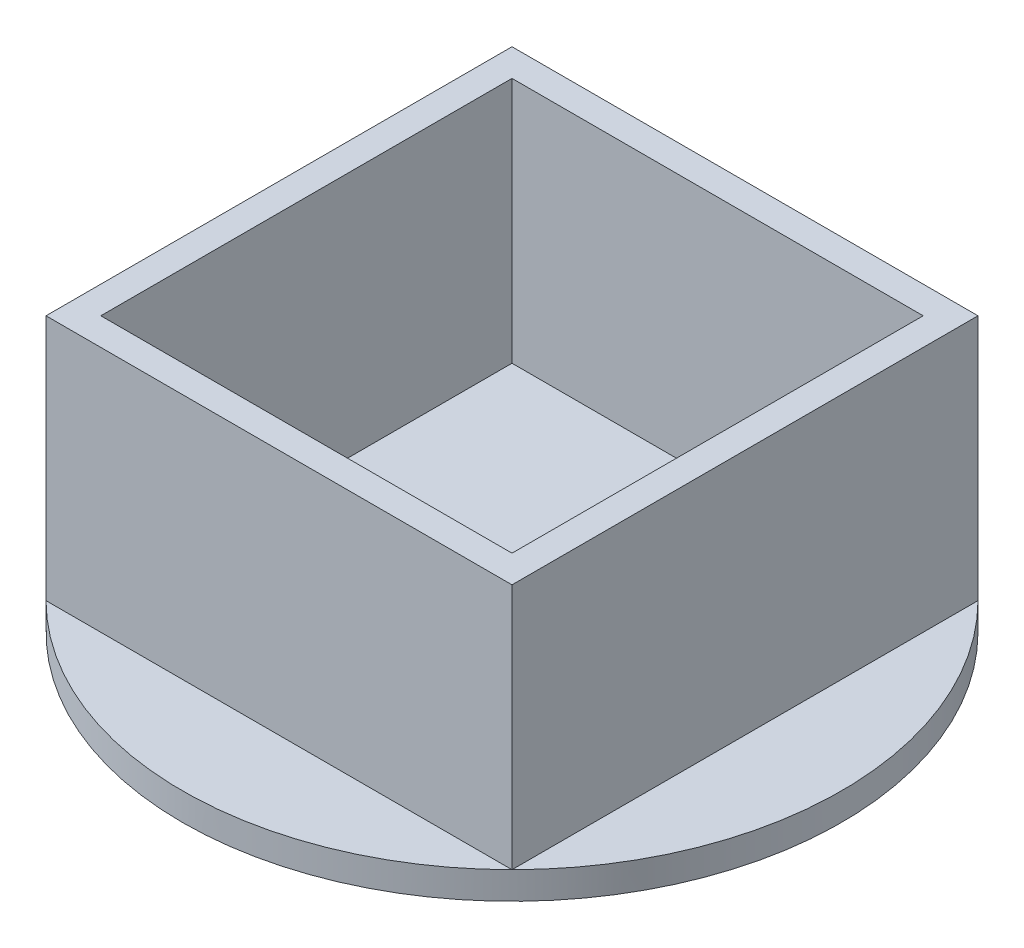
ISO-10303-21;
HEADER;
FILE_DESCRIPTION(('STEP AP214'),'2;1');
FILE_NAME('part.step','',(''),(''),'','','');
FILE_SCHEMA(('AUTOMOTIVE_DESIGN { 1 0 10303 214 1 1 1 1 }'));
ENDSEC;
DATA;
#1=APPLICATION_CONTEXT('core data for automotive mechanical design processes');
#2=APPLICATION_PROTOCOL_DEFINITION('international standard','automotive_design',2000,#1);
#3=PRODUCT_CONTEXT('',#1,'mechanical');
#4=PRODUCT('Part','Part','',(#3));
#5=PRODUCT_RELATED_PRODUCT_CATEGORY('part','',(#4));
#6=PRODUCT_DEFINITION_FORMATION('','',#4);
#7=PRODUCT_DEFINITION_CONTEXT('part definition',#1,'design');
#8=PRODUCT_DEFINITION('design','',#6,#7);
#9=PRODUCT_DEFINITION_SHAPE('','',#8);
#10=(LENGTH_UNIT() NAMED_UNIT(*) SI_UNIT(.MILLI.,.METRE.));
#11=(NAMED_UNIT(*) PLANE_ANGLE_UNIT() SI_UNIT($,.RADIAN.));
#12=(NAMED_UNIT(*) SI_UNIT($,.STERADIAN.) SOLID_ANGLE_UNIT());
#13=UNCERTAINTY_MEASURE_WITH_UNIT(LENGTH_MEASURE(1.E-05),#10,'distance_accuracy_value','');
#14=(GEOMETRIC_REPRESENTATION_CONTEXT(3) GLOBAL_UNCERTAINTY_ASSIGNED_CONTEXT((#13)) GLOBAL_UNIT_ASSIGNED_CONTEXT((#10,
#11,#12)) REPRESENTATION_CONTEXT('',''));
#15=CARTESIAN_POINT('',(0.,0.,0.));
#16=DIRECTION('',(0.,0.,1.));
#17=DIRECTION('',(1.,0.,0.));
#18=AXIS2_PLACEMENT_3D('',#15,#16,#17);
#19=CARTESIAN_POINT('',(0.,10.,0.));
#20=DIRECTION('',(0.,1.,0.));
#21=DIRECTION('',(0.,0.,1.));
#22=AXIS2_PLACEMENT_3D('',#19,#20,#21);
#23=PLANE('',#22);
#24=DIRECTION('',(0.,0.,-1.));
#25=VECTOR('',#24,1.);
#26=CARTESIAN_POINT('',(8.5,10.,-7.5));
#27=LINE('',#26,#25);
#28=CARTESIAN_POINT('',(8.5,10.,8.5));
#29=VERTEX_POINT('',#28);
#30=CARTESIAN_POINT('',(8.5,10.,-8.5));
#31=VERTEX_POINT('',#30);
#32=EDGE_CURVE('E171',#29,#31,#27,.T.);
#33=ORIENTED_EDGE('',*,*,#32,.T.);
#34=DIRECTION('',(-1.,0.,0.));
#35=VECTOR('',#34,1.);
#36=CARTESIAN_POINT('',(-7.5,10.,-8.5));
#37=LINE('',#36,#35);
#38=CARTESIAN_POINT('',(-8.5,10.,-8.5));
#39=VERTEX_POINT('',#38);
#40=EDGE_CURVE('E157',#31,#39,#37,.T.);
#41=ORIENTED_EDGE('',*,*,#40,.T.);
#42=DIRECTION('',(0.,0.,1.));
#43=VECTOR('',#42,1.);
#44=CARTESIAN_POINT('',(-8.5,10.,-7.5));
#45=LINE('',#44,#43);
#46=CARTESIAN_POINT('',(-8.5,10.,8.5));
#47=VERTEX_POINT('',#46);
#48=EDGE_CURVE('E168',#39,#47,#45,.T.);
#49=ORIENTED_EDGE('',*,*,#48,.T.);
#50=DIRECTION('',(1.,0.,0.));
#51=VECTOR('',#50,1.);
#52=CARTESIAN_POINT('',(-7.5,10.,8.5));
#53=LINE('',#52,#51);
#54=EDGE_CURVE('E166',#47,#29,#53,.T.);
#55=ORIENTED_EDGE('',*,*,#54,.T.);
#56=EDGE_LOOP('',(#33,#41,#49,#55));
#57=FACE_BOUND('',#56,.T.);
#58=DIRECTION('',(-1.,0.,0.));
#59=VECTOR('',#58,1.);
#60=CARTESIAN_POINT('',(-7.5,10.,-7.5));
#61=LINE('',#60,#59);
#62=CARTESIAN_POINT('',(7.5,10.,-7.5));
#63=VERTEX_POINT('',#62);
#64=CARTESIAN_POINT('',(-7.5,10.,-7.5));
#65=VERTEX_POINT('',#64);
#66=EDGE_CURVE('E187',#63,#65,#61,.T.);
#67=ORIENTED_EDGE('',*,*,#66,.F.);
#68=DIRECTION('',(0.,0.,-1.));
#69=VECTOR('',#68,1.);
#70=CARTESIAN_POINT('',(7.5,10.,-7.5));
#71=LINE('',#70,#69);
#72=CARTESIAN_POINT('',(7.5,10.,7.5));
#73=VERTEX_POINT('',#72);
#74=EDGE_CURVE('E154',#73,#63,#71,.T.);
#75=ORIENTED_EDGE('',*,*,#74,.F.);
#76=DIRECTION('',(1.,0.,0.));
#77=VECTOR('',#76,1.);
#78=CARTESIAN_POINT('',(-7.5,10.,7.5));
#79=LINE('',#78,#77);
#80=CARTESIAN_POINT('',(-7.5,10.,7.5));
#81=VERTEX_POINT('',#80);
#82=EDGE_CURVE('E182',#81,#73,#79,.T.);
#83=ORIENTED_EDGE('',*,*,#82,.F.);
#84=DIRECTION('',(0.,0.,1.));
#85=VECTOR('',#84,1.);
#86=CARTESIAN_POINT('',(-7.5,10.,-7.5));
#87=LINE('',#86,#85);
#88=EDGE_CURVE('E184',#65,#81,#87,.T.);
#89=ORIENTED_EDGE('',*,*,#88,.F.);
#90=EDGE_LOOP('',(#67,#75,#83,#89));
#91=FACE_BOUND('',#90,.T.);
#92=ADVANCED_FACE('F57',(#57,#91),#23,.T.);
#93=CARTESIAN_POINT('',(8.5,10.,-7.5));
#94=DIRECTION('',(-1.,0.,0.));
#95=DIRECTION('',(0.,0.,1.));
#96=AXIS2_PLACEMENT_3D('',#93,#94,#95);
#97=PLANE('',#96);
#98=DIRECTION('',(0.,-1.,0.));
#99=VECTOR('',#98,1.);
#100=CARTESIAN_POINT('',(8.5,10.,8.5));
#101=LINE('',#100,#99);
#102=CARTESIAN_POINT('',(8.5,0.999999999999999,8.5));
#103=VERTEX_POINT('',#102);
#104=EDGE_CURVE('E153',#29,#103,#101,.T.);
#105=ORIENTED_EDGE('',*,*,#104,.T.);
#106=DIRECTION('',(0.,0.,-1.));
#107=VECTOR('',#106,1.);
#108=CARTESIAN_POINT('',(8.5,0.999999999999999,-7.5));
#109=LINE('',#108,#107);
#110=CARTESIAN_POINT('',(8.5,1.,-8.5));
#111=VERTEX_POINT('',#110);
#112=EDGE_CURVE('E133',#103,#111,#109,.T.);
#113=ORIENTED_EDGE('',*,*,#112,.T.);
#114=DIRECTION('',(0.,-1.,0.));
#115=VECTOR('',#114,1.);
#116=CARTESIAN_POINT('',(8.5,10.,-8.5));
#117=LINE('',#116,#115);
#118=EDGE_CURVE('E65',#31,#111,#117,.T.);
#119=ORIENTED_EDGE('',*,*,#118,.F.);
#120=ORIENTED_EDGE('',*,*,#32,.F.);
#121=EDGE_LOOP('',(#105,#113,#119,#120));
#122=FACE_BOUND('',#121,.T.);
#123=ADVANCED_FACE('F59',(#122),#97,.F.);
#124=CARTESIAN_POINT('',(-7.5,10.,-8.5));
#125=DIRECTION('',(0.,0.,1.));
#126=DIRECTION('',(1.,0.,0.));
#127=AXIS2_PLACEMENT_3D('',#124,#125,#126);
#128=PLANE('',#127);
#129=ORIENTED_EDGE('',*,*,#118,.T.);
#130=DIRECTION('',(-1.,0.,0.));
#131=VECTOR('',#130,1.);
#132=CARTESIAN_POINT('',(-7.5,0.999999999999999,-8.5));
#133=LINE('',#132,#131);
#134=CARTESIAN_POINT('',(-8.5,1.,-8.5));
#135=VERTEX_POINT('',#134);
#136=EDGE_CURVE('E126',#111,#135,#133,.T.);
#137=ORIENTED_EDGE('',*,*,#136,.T.);
#138=DIRECTION('',(0.,-1.,0.));
#139=VECTOR('',#138,1.);
#140=CARTESIAN_POINT('',(-8.5,10.,-8.5));
#141=LINE('',#140,#139);
#142=EDGE_CURVE('E159',#39,#135,#141,.T.);
#143=ORIENTED_EDGE('',*,*,#142,.F.);
#144=ORIENTED_EDGE('',*,*,#40,.F.);
#145=EDGE_LOOP('',(#129,#137,#143,#144));
#146=FACE_BOUND('',#145,.T.);
#147=ADVANCED_FACE('F156',(#146),#128,.F.);
#148=CARTESIAN_POINT('',(-8.5,10.,-7.5));
#149=DIRECTION('',(1.,0.,0.));
#150=DIRECTION('',(0.,0.,-1.));
#151=AXIS2_PLACEMENT_3D('',#148,#149,#150);
#152=PLANE('',#151);
#153=ORIENTED_EDGE('',*,*,#142,.T.);
#154=DIRECTION('',(0.,0.,1.));
#155=VECTOR('',#154,1.);
#156=CARTESIAN_POINT('',(-8.5,0.999999999999999,-7.5));
#157=LINE('',#156,#155);
#158=CARTESIAN_POINT('',(-8.5,1.,8.5));
#159=VERTEX_POINT('',#158);
#160=EDGE_CURVE('E134',#135,#159,#157,.T.);
#161=ORIENTED_EDGE('',*,*,#160,.T.);
#162=DIRECTION('',(0.,-1.,0.));
#163=VECTOR('',#162,1.);
#164=CARTESIAN_POINT('',(-8.5,10.,8.5));
#165=LINE('',#164,#163);
#166=EDGE_CURVE('E160',#47,#159,#165,.T.);
#167=ORIENTED_EDGE('',*,*,#166,.F.);
#168=ORIENTED_EDGE('',*,*,#48,.F.);
#169=EDGE_LOOP('',(#153,#161,#167,#168));
#170=FACE_BOUND('',#169,.T.);
#171=ADVANCED_FACE('F209',(#170),#152,.F.);
#172=CARTESIAN_POINT('',(-7.5,10.,8.5));
#173=DIRECTION('',(0.,0.,-1.));
#174=DIRECTION('',(-1.,0.,0.));
#175=AXIS2_PLACEMENT_3D('',#172,#173,#174);
#176=PLANE('',#175);
#177=ORIENTED_EDGE('',*,*,#166,.T.);
#178=DIRECTION('',(1.,0.,0.));
#179=VECTOR('',#178,1.);
#180=CARTESIAN_POINT('',(-7.5,0.999999999999999,8.5));
#181=LINE('',#180,#179);
#182=EDGE_CURVE('E192',#159,#103,#181,.T.);
#183=ORIENTED_EDGE('',*,*,#182,.T.);
#184=ORIENTED_EDGE('',*,*,#104,.F.);
#185=ORIENTED_EDGE('',*,*,#54,.F.);
#186=EDGE_LOOP('',(#177,#183,#184,#185));
#187=FACE_BOUND('',#186,.T.);
#188=ADVANCED_FACE('F213',(#187),#176,.F.);
#189=CARTESIAN_POINT('',(7.5,10.,-7.5));
#190=DIRECTION('',(-1.,0.,0.));
#191=DIRECTION('',(0.,0.,1.));
#192=AXIS2_PLACEMENT_3D('',#189,#190,#191);
#193=PLANE('',#192);
#194=DIRECTION('',(0.,0.,-1.));
#195=VECTOR('',#194,1.);
#196=CARTESIAN_POINT('',(7.5,0.999999999999999,-7.5));
#197=LINE('',#196,#195);
#198=CARTESIAN_POINT('',(7.5,0.999999999999999,7.5));
#199=VERTEX_POINT('',#198);
#200=CARTESIAN_POINT('',(7.5,0.999999999999999,-7.5));
#201=VERTEX_POINT('',#200);
#202=EDGE_CURVE('E194',#199,#201,#197,.T.);
#203=ORIENTED_EDGE('',*,*,#202,.F.);
#204=DIRECTION('',(0.,-1.,0.));
#205=VECTOR('',#204,1.);
#206=CARTESIAN_POINT('',(7.5,10.,7.5));
#207=LINE('',#206,#205);
#208=EDGE_CURVE('E180',#73,#199,#207,.T.);
#209=ORIENTED_EDGE('',*,*,#208,.F.);
#210=ORIENTED_EDGE('',*,*,#74,.T.);
#211=DIRECTION('',(0.,-1.,0.));
#212=VECTOR('',#211,1.);
#213=CARTESIAN_POINT('',(7.5,10.,-7.5));
#214=LINE('',#213,#212);
#215=EDGE_CURVE('E173',#63,#201,#214,.T.);
#216=ORIENTED_EDGE('',*,*,#215,.T.);
#217=EDGE_LOOP('',(#203,#209,#210,#216));
#218=FACE_BOUND('',#217,.T.);
#219=ADVANCED_FACE('F231',(#218),#193,.T.);
#220=CARTESIAN_POINT('',(-7.5,10.,-7.5));
#221=DIRECTION('',(0.,0.,1.));
#222=DIRECTION('',(1.,0.,0.));
#223=AXIS2_PLACEMENT_3D('',#220,#221,#222);
#224=PLANE('',#223);
#225=DIRECTION('',(-1.,0.,0.));
#226=VECTOR('',#225,1.);
#227=CARTESIAN_POINT('',(-7.5,0.999999999999999,-7.5));
#228=LINE('',#227,#226);
#229=CARTESIAN_POINT('',(-7.5,0.999999999999999,-7.5));
#230=VERTEX_POINT('',#229);
#231=EDGE_CURVE('E80',#201,#230,#228,.T.);
#232=ORIENTED_EDGE('',*,*,#231,.F.);
#233=ORIENTED_EDGE('',*,*,#215,.F.);
#234=ORIENTED_EDGE('',*,*,#66,.T.);
#235=DIRECTION('',(0.,-1.,0.));
#236=VECTOR('',#235,1.);
#237=CARTESIAN_POINT('',(-7.5,10.,-7.5));
#238=LINE('',#237,#236);
#239=EDGE_CURVE('E175',#65,#230,#238,.T.);
#240=ORIENTED_EDGE('',*,*,#239,.T.);
#241=EDGE_LOOP('',(#232,#233,#234,#240));
#242=FACE_BOUND('',#241,.T.);
#243=ADVANCED_FACE('F223',(#242),#224,.T.);
#244=CARTESIAN_POINT('',(-7.5,10.,-7.5));
#245=DIRECTION('',(1.,0.,0.));
#246=DIRECTION('',(0.,0.,-1.));
#247=AXIS2_PLACEMENT_3D('',#244,#245,#246);
#248=PLANE('',#247);
#249=DIRECTION('',(0.,0.,1.));
#250=VECTOR('',#249,1.);
#251=CARTESIAN_POINT('',(-7.5,0.999999999999999,-7.5));
#252=LINE('',#251,#250);
#253=CARTESIAN_POINT('',(-7.5,0.999999999999999,7.5));
#254=VERTEX_POINT('',#253);
#255=EDGE_CURVE('E146',#230,#254,#252,.T.);
#256=ORIENTED_EDGE('',*,*,#255,.F.);
#257=ORIENTED_EDGE('',*,*,#239,.F.);
#258=ORIENTED_EDGE('',*,*,#88,.T.);
#259=DIRECTION('',(0.,-1.,0.));
#260=VECTOR('',#259,1.);
#261=CARTESIAN_POINT('',(-7.5,10.,7.5));
#262=LINE('',#261,#260);
#263=EDGE_CURVE('E177',#81,#254,#262,.T.);
#264=ORIENTED_EDGE('',*,*,#263,.T.);
#265=EDGE_LOOP('',(#256,#257,#258,#264));
#266=FACE_BOUND('',#265,.T.);
#267=ADVANCED_FACE('F225',(#266),#248,.T.);
#268=CARTESIAN_POINT('',(-7.5,10.,7.5));
#269=DIRECTION('',(0.,0.,-1.));
#270=DIRECTION('',(-1.,0.,0.));
#271=AXIS2_PLACEMENT_3D('',#268,#269,#270);
#272=PLANE('',#271);
#273=DIRECTION('',(1.,0.,0.));
#274=VECTOR('',#273,1.);
#275=CARTESIAN_POINT('',(-7.5,0.999999999999999,7.5));
#276=LINE('',#275,#274);
#277=EDGE_CURVE('E12',#254,#199,#276,.T.);
#278=ORIENTED_EDGE('',*,*,#277,.F.);
#279=ORIENTED_EDGE('',*,*,#263,.F.);
#280=ORIENTED_EDGE('',*,*,#82,.T.);
#281=ORIENTED_EDGE('',*,*,#208,.T.);
#282=EDGE_LOOP('',(#278,#279,#280,#281));
#283=FACE_BOUND('',#282,.T.);
#284=ADVANCED_FACE('F233',(#283),#272,.T.);
#285=CARTESIAN_POINT('',(0.,1.,0.));
#286=DIRECTION('',(0.,1.,0.));
#287=DIRECTION('',(0.,0.,1.));
#288=AXIS2_PLACEMENT_3D('',#285,#286,#287);
#289=PLANE('',#288);
#290=ORIENTED_EDGE('',*,*,#277,.T.);
#291=ORIENTED_EDGE('',*,*,#202,.T.);
#292=ORIENTED_EDGE('',*,*,#231,.T.);
#293=ORIENTED_EDGE('',*,*,#255,.T.);
#294=EDGE_LOOP('',(#290,#291,#292,#293));
#295=FACE_BOUND('',#294,.T.);
#296=ADVANCED_FACE('F227',(#295),#289,.T.);
#297=CARTESIAN_POINT('',(0.,1.,0.));
#298=DIRECTION('',(0.,-1.,0.));
#299=DIRECTION('',(0.,0.,-1.));
#300=AXIS2_PLACEMENT_3D('',#297,#298,#299);
#301=CYLINDRICAL_SURFACE('',#300,12.0208152801713);
#302=CARTESIAN_POINT('',(0.,0.,0.));
#303=DIRECTION('',(0.,1.,0.));
#304=DIRECTION('',(0.,0.,1.));
#305=AXIS2_PLACEMENT_3D('',#302,#303,#304);
#306=CIRCLE('',#305,12.0208152801713);
#307=CARTESIAN_POINT('',(0.,0.,12.0208152801713));
#308=VERTEX_POINT('',#307);
#309=EDGE_CURVE('E200',#308,#308,#306,.T.);
#310=ORIENTED_EDGE('',*,*,#309,.T.);
#311=EDGE_LOOP('',(#310));
#312=FACE_BOUND('',#311,.T.);
#313=CARTESIAN_POINT('',(0.,1.,0.));
#314=DIRECTION('',(0.,1.,0.));
#315=DIRECTION('',(0.,0.,1.));
#316=AXIS2_PLACEMENT_3D('',#313,#314,#315);
#317=CIRCLE('',#316,12.0208152801713);
#318=EDGE_CURVE('E128',#111,#135,#317,.T.);
#319=ORIENTED_EDGE('',*,*,#318,.F.);
#320=EDGE_CURVE('E72',#103,#111,#317,.T.);
#321=ORIENTED_EDGE('',*,*,#320,.F.);
#322=EDGE_CURVE('E147',#159,#103,#317,.T.);
#323=ORIENTED_EDGE('',*,*,#322,.F.);
#324=EDGE_CURVE('E139',#135,#159,#317,.T.);
#325=ORIENTED_EDGE('',*,*,#324,.F.);
#326=EDGE_LOOP('',(#319,#321,#323,#325));
#327=FACE_BOUND('',#326,.T.);
#328=ADVANCED_FACE('F137',(#312,#327),#301,.T.);
#329=ORIENTED_EDGE('',*,*,#112,.F.);
#330=ORIENTED_EDGE('',*,*,#320,.T.);
#331=EDGE_LOOP('',(#329,#330));
#332=FACE_BOUND('',#331,.T.);
#333=ADVANCED_FACE('F144',(#332),#289,.T.);
#334=ORIENTED_EDGE('',*,*,#136,.F.);
#335=ORIENTED_EDGE('',*,*,#318,.T.);
#336=EDGE_LOOP('',(#334,#335));
#337=FACE_BOUND('',#336,.T.);
#338=ADVANCED_FACE('F127',(#337),#289,.T.);
#339=ORIENTED_EDGE('',*,*,#160,.F.);
#340=ORIENTED_EDGE('',*,*,#324,.T.);
#341=EDGE_LOOP('',(#339,#340));
#342=FACE_BOUND('',#341,.T.);
#343=ADVANCED_FACE('F206',(#342),#289,.T.);
#344=ORIENTED_EDGE('',*,*,#182,.F.);
#345=ORIENTED_EDGE('',*,*,#322,.T.);
#346=EDGE_LOOP('',(#344,#345));
#347=FACE_BOUND('',#346,.T.);
#348=ADVANCED_FACE('F241',(#347),#289,.T.);
#349=CARTESIAN_POINT('',(0.,0.,0.));
#350=DIRECTION('',(0.,1.,0.));
#351=DIRECTION('',(0.,0.,1.));
#352=AXIS2_PLACEMENT_3D('',#349,#350,#351);
#353=PLANE('',#352);
#354=ORIENTED_EDGE('',*,*,#309,.F.);
#355=EDGE_LOOP('',(#354));
#356=FACE_BOUND('',#355,.T.);
#357=ADVANCED_FACE('F249',(#356),#353,.F.);
#358=CLOSED_SHELL('',(#92,#123,#147,#171,#188,#219,#243,#267,#284,#296,#328,#333,#338,#343,#348,#357));
#359=MANIFOLD_SOLID_BREP('B2',#358);
#360=ADVANCED_BREP_SHAPE_REPRESENTATION('',(#18,#359),#14);
#361=SHAPE_DEFINITION_REPRESENTATION(#9,#360);
ENDSEC;
END-ISO-10303-21;
